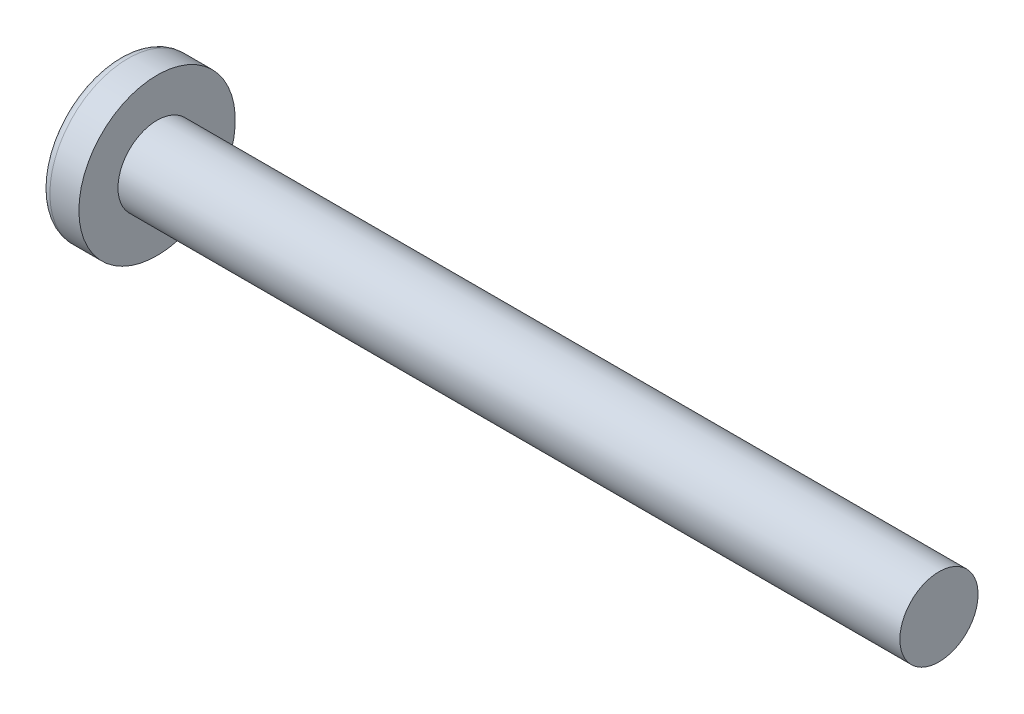
ISO-10303-21;
HEADER;
FILE_DESCRIPTION(('STEP AP214'),'2;1');
FILE_NAME('part.step','',(''),(''),'','','');
FILE_SCHEMA(('AUTOMOTIVE_DESIGN { 1 0 10303 214 1 1 1 1 }'));
ENDSEC;
DATA;
#1=APPLICATION_CONTEXT('core data for automotive mechanical design processes');
#2=APPLICATION_PROTOCOL_DEFINITION('international standard','automotive_design',2000,#1);
#3=PRODUCT_CONTEXT('',#1,'mechanical');
#4=PRODUCT('Part','Part','',(#3));
#5=PRODUCT_RELATED_PRODUCT_CATEGORY('part','',(#4));
#6=PRODUCT_DEFINITION_FORMATION('','',#4);
#7=PRODUCT_DEFINITION_CONTEXT('part definition',#1,'design');
#8=PRODUCT_DEFINITION('design','',#6,#7);
#9=PRODUCT_DEFINITION_SHAPE('','',#8);
#10=(LENGTH_UNIT() NAMED_UNIT(*) SI_UNIT(.MILLI.,.METRE.));
#11=(NAMED_UNIT(*) PLANE_ANGLE_UNIT() SI_UNIT($,.RADIAN.));
#12=(NAMED_UNIT(*) SI_UNIT($,.STERADIAN.) SOLID_ANGLE_UNIT());
#13=UNCERTAINTY_MEASURE_WITH_UNIT(LENGTH_MEASURE(1.E-05),#10,'distance_accuracy_value','');
#14=(GEOMETRIC_REPRESENTATION_CONTEXT(3) GLOBAL_UNCERTAINTY_ASSIGNED_CONTEXT((#13)) GLOBAL_UNIT_ASSIGNED_CONTEXT((#10,
#11,#12)) REPRESENTATION_CONTEXT('',''));
#15=CARTESIAN_POINT('',(0.,0.,0.));
#16=DIRECTION('',(0.,0.,1.));
#17=DIRECTION('',(1.,0.,0.));
#18=AXIS2_PLACEMENT_3D('',#15,#16,#17);
#19=CARTESIAN_POINT('',(6.5,0.,0.));
#20=DIRECTION('',(-1.,0.,0.));
#21=DIRECTION('',(0.,1.,0.));
#22=AXIS2_PLACEMENT_3D('',#19,#20,#21);
#23=SPHERICAL_SURFACE('',#22,6.5);
#24=CARTESIAN_POINT('',(1.22696010591455,0.,0.));
#25=DIRECTION('',(-1.,0.,0.));
#26=DIRECTION('',(0.,0.,1.));
#27=AXIS2_PLACEMENT_3D('',#24,#25,#26);
#28=CIRCLE('',#27,3.80066445182724);
#29=CARTESIAN_POINT('',(1.22696010591455,0.,3.80066445182724));
#30=VERTEX_POINT('',#29);
#31=EDGE_CURVE('E172',#30,#30,#28,.T.);
#32=ORIENTED_EDGE('',*,*,#31,.T.);
#33=EDGE_LOOP('',(#32));
#34=FACE_BOUND('',#33,.T.);
#35=CARTESIAN_POINT('',(6.48571960757402,-0.15048155459631,0.));
#36=DIRECTION('',(-0.0944735162161081,-0.995527375180494,0.));
#37=DIRECTION('',(0.995527375180494,-0.0944735162161081,0.));
#38=AXIS2_PLACEMENT_3D('',#35,#36,#37);
#39=CIRCLE('',#38,6.49824217555167);
#40=CARTESIAN_POINT('',(0.314004666074212,0.4352015980154,1.94783502836694));
#41=VERTEX_POINT('',#40);
#42=CARTESIAN_POINT('',(0.0329034112486444,0.461877533422321,0.461877533422323));
#43=VERTEX_POINT('',#42);
#44=EDGE_CURVE('E214',#41,#43,#39,.T.);
#45=ORIENTED_EDGE('',*,*,#44,.F.);
#46=CARTESIAN_POINT('',(5.02565375064329,0.,-1.83590765485334));
#47=DIRECTION('',(0.626149356629992,0.,0.779703137861998));
#48=DIRECTION('',(0.779703137861998,0.,-0.626149356629992));
#49=AXIS2_PLACEMENT_3D('',#46,#47,#48);
#50=CIRCLE('',#49,6.05852673674539);
#51=CARTESIAN_POINT('',(0.314004666074212,-0.435201598015413,1.94783502836693));
#52=VERTEX_POINT('',#51);
#53=EDGE_CURVE('E167',#41,#52,#50,.T.);
#54=ORIENTED_EDGE('',*,*,#53,.T.);
#55=CARTESIAN_POINT('',(6.48571960757402,0.15048155459631,0.));
#56=DIRECTION('',(-0.0944735162161081,0.995527375180494,0.));
#57=DIRECTION('',(-0.995527375180494,-0.0944735162161081,0.));
#58=AXIS2_PLACEMENT_3D('',#55,#56,#57);
#59=CIRCLE('',#58,6.49824217555167);
#60=CARTESIAN_POINT('',(0.0329034112486444,-0.461877533422324,0.461877533422322));
#61=VERTEX_POINT('',#60);
#62=EDGE_CURVE('E116',#61,#52,#59,.T.);
#63=ORIENTED_EDGE('',*,*,#62,.F.);
#64=CARTESIAN_POINT('',(6.48571960757402,0.,-0.15048155459631));
#65=DIRECTION('',(-0.0944735162161081,0.,-0.995527375180494));
#66=DIRECTION('',(-0.995527375180494,0.,0.0944735162161081));
#67=AXIS2_PLACEMENT_3D('',#64,#65,#66);
#68=CIRCLE('',#67,6.49824217555167);
#69=CARTESIAN_POINT('',(0.314004666074212,-1.94783502836693,0.435201598015406));
#70=VERTEX_POINT('',#69);
#71=EDGE_CURVE('E143',#70,#61,#68,.T.);
#72=ORIENTED_EDGE('',*,*,#71,.F.);
#73=CARTESIAN_POINT('',(5.02565375064329,1.83590765485334,0.));
#74=DIRECTION('',(0.626149356629992,-0.779703137861998,0.));
#75=DIRECTION('',(0.779703137861998,0.626149356629992,0.));
#76=AXIS2_PLACEMENT_3D('',#73,#74,#75);
#77=CIRCLE('',#76,6.05852673674539);
#78=CARTESIAN_POINT('',(0.314004666074212,-1.94783502836693,-0.435201598015406));
#79=VERTEX_POINT('',#78);
#80=EDGE_CURVE('E152',#70,#79,#77,.T.);
#81=ORIENTED_EDGE('',*,*,#80,.T.);
#82=CARTESIAN_POINT('',(6.48571960757402,0.,0.15048155459631));
#83=DIRECTION('',(-0.0944735162161081,0.,0.995527375180494));
#84=DIRECTION('',(0.995527375180494,0.,0.0944735162161081));
#85=AXIS2_PLACEMENT_3D('',#82,#83,#84);
#86=CIRCLE('',#85,6.49824217555167);
#87=CARTESIAN_POINT('',(0.0329034112486444,-0.461877533422321,-0.461877533422323));
#88=VERTEX_POINT('',#87);
#89=EDGE_CURVE('E59',#88,#79,#86,.T.);
#90=ORIENTED_EDGE('',*,*,#89,.F.);
#91=CARTESIAN_POINT('',(0.314004666074212,-0.435201598015399,-1.94783502836693));
#92=VERTEX_POINT('',#91);
#93=EDGE_CURVE('E221',#92,#88,#59,.T.);
#94=ORIENTED_EDGE('',*,*,#93,.F.);
#95=CARTESIAN_POINT('',(5.02565375064329,0.,1.83590765485334));
#96=DIRECTION('',(0.626149356629992,0.,-0.779703137861998));
#97=DIRECTION('',(-0.779703137861998,0.,-0.626149356629992));
#98=AXIS2_PLACEMENT_3D('',#95,#96,#97);
#99=CIRCLE('',#98,6.05852673674539);
#100=CARTESIAN_POINT('',(0.314004666074212,0.435201598015413,-1.94783502836693));
#101=VERTEX_POINT('',#100);
#102=EDGE_CURVE('E145',#92,#101,#99,.T.);
#103=ORIENTED_EDGE('',*,*,#102,.T.);
#104=CARTESIAN_POINT('',(0.0329034112486444,0.461877533422324,-0.461877533422323));
#105=VERTEX_POINT('',#104);
#106=EDGE_CURVE('E210',#105,#101,#39,.T.);
#107=ORIENTED_EDGE('',*,*,#106,.F.);
#108=CARTESIAN_POINT('',(0.314004666074212,1.94783502836693,-0.435201598015406));
#109=VERTEX_POINT('',#108);
#110=EDGE_CURVE('E52',#109,#105,#86,.T.);
#111=ORIENTED_EDGE('',*,*,#110,.F.);
#112=CARTESIAN_POINT('',(5.02565375064329,-1.83590765485334,0.));
#113=DIRECTION('',(0.626149356629992,0.779703137861998,0.));
#114=DIRECTION('',(-0.779703137861998,0.626149356629992,0.));
#115=AXIS2_PLACEMENT_3D('',#112,#113,#114);
#116=CIRCLE('',#115,6.05852673674539);
#117=CARTESIAN_POINT('',(0.314004666074212,1.94783502836693,0.435201598015407));
#118=VERTEX_POINT('',#117);
#119=EDGE_CURVE('E11',#109,#118,#116,.T.);
#120=ORIENTED_EDGE('',*,*,#119,.T.);
#121=EDGE_CURVE('E191',#43,#118,#68,.T.);
#122=ORIENTED_EDGE('',*,*,#121,.F.);
#123=EDGE_LOOP('',(#45,#54,#63,#72,#81,#90,#94,#103,#107,#111,#120,#122));
#124=FACE_BOUND('',#123,.T.);
#125=ADVANCED_FACE('F43',(#34,#124),#23,.T.);
#126=CARTESIAN_POINT('',(2.73951715374841,0.,-0.20502541296061));
#127=DIRECTION('',(-0.0944735162161081,0.,0.995527375180494));
#128=DIRECTION('',(0.995527375180494,0.,0.0944735162161081));
#129=AXIS2_PLACEMENT_3D('',#126,#127,#128);
#130=PLANE('',#129);
#131=ORIENTED_EDGE('',*,*,#110,.T.);
#132=DIRECTION('',(0.991114231601325,-0.0940547178968607,0.0940547178968604));
#133=VECTOR('',#132,1.);
#134=CARTESIAN_POINT('',(2.75862941145706,0.203211698708667,-0.203211698708667));
#135=LINE('',#134,#133);
#136=CARTESIAN_POINT('',(2.45,0.232500000000001,-0.232499999999999));
#137=VERTEX_POINT('',#136);
#138=EDGE_CURVE('E211',#105,#137,#135,.T.);
#139=ORIENTED_EDGE('',*,*,#138,.T.);
#140=DIRECTION('',(0.777577482844895,-0.624442325509115,0.0737905162291584));
#141=VECTOR('',#140,1.);
#142=CARTESIAN_POINT('',(0.,2.2,-0.465));
#143=LINE('',#142,#141);
#144=EDGE_CURVE('E173',#109,#137,#143,.T.);
#145=ORIENTED_EDGE('',*,*,#144,.F.);
#146=EDGE_LOOP('',(#131,#139,#145));
#147=FACE_BOUND('',#146,.T.);
#148=ADVANCED_FACE('F254',(#147),#130,.T.);
#149=DIRECTION('',(0.777577482844895,0.624442325509115,0.0737905162291584));
#150=VECTOR('',#149,1.);
#151=CARTESIAN_POINT('',(0.,-2.2,-0.465));
#152=LINE('',#151,#150);
#153=CARTESIAN_POINT('',(2.45,-0.2325,-0.2325));
#154=VERTEX_POINT('',#153);
#155=EDGE_CURVE('E154',#79,#154,#152,.T.);
#156=ORIENTED_EDGE('',*,*,#155,.T.);
#157=DIRECTION('',(-0.991114231601325,-0.09405471789686,-0.0940547178968604));
#158=VECTOR('',#157,1.);
#159=CARTESIAN_POINT('',(2.75862941145706,-0.203211698708666,-0.203211698708667));
#160=LINE('',#159,#158);
#161=EDGE_CURVE('E222',#154,#88,#160,.T.);
#162=ORIENTED_EDGE('',*,*,#161,.T.);
#163=ORIENTED_EDGE('',*,*,#89,.T.);
#164=EDGE_LOOP('',(#156,#162,#163));
#165=FACE_BOUND('',#164,.T.);
#166=ADVANCED_FACE('F251',(#165),#130,.T.);
#167=CARTESIAN_POINT('',(2.73951715374841,0.,0.20502541296061));
#168=DIRECTION('',(-0.0944735162161081,0.,-0.995527375180494));
#169=DIRECTION('',(-0.995527375180494,0.,0.0944735162161081));
#170=AXIS2_PLACEMENT_3D('',#167,#168,#169);
#171=PLANE('',#170);
#172=DIRECTION('',(0.777577482844895,-0.624442325509115,-0.0737905162291584));
#173=VECTOR('',#172,1.);
#174=CARTESIAN_POINT('',(0.,2.2,0.465));
#175=LINE('',#174,#173);
#176=CARTESIAN_POINT('',(2.45,0.2325,0.2325));
#177=VERTEX_POINT('',#176);
#178=EDGE_CURVE('E202',#118,#177,#175,.T.);
#179=ORIENTED_EDGE('',*,*,#178,.T.);
#180=DIRECTION('',(-0.991114231601325,0.0940547178968601,0.0940547178968603));
#181=VECTOR('',#180,1.);
#182=CARTESIAN_POINT('',(2.75862941145706,0.203211698708666,0.203211698708667));
#183=LINE('',#182,#181);
#184=EDGE_CURVE('E217',#177,#43,#183,.T.);
#185=ORIENTED_EDGE('',*,*,#184,.T.);
#186=ORIENTED_EDGE('',*,*,#121,.T.);
#187=EDGE_LOOP('',(#179,#185,#186));
#188=FACE_BOUND('',#187,.T.);
#189=ADVANCED_FACE('F253',(#188),#171,.T.);
#190=ORIENTED_EDGE('',*,*,#71,.T.);
#191=DIRECTION('',(0.991114231601325,0.0940547178968607,-0.0940547178968603));
#192=VECTOR('',#191,1.);
#193=CARTESIAN_POINT('',(2.75862941145706,-0.203211698708668,0.203211698708667));
#194=LINE('',#193,#192);
#195=CARTESIAN_POINT('',(2.45,-0.232500000000001,0.232499999999999));
#196=VERTEX_POINT('',#195);
#197=EDGE_CURVE('E114',#61,#196,#194,.T.);
#198=ORIENTED_EDGE('',*,*,#197,.T.);
#199=DIRECTION('',(0.777577482844895,0.624442325509115,-0.0737905162291583));
#200=VECTOR('',#199,1.);
#201=CARTESIAN_POINT('',(0.,-2.2,0.465));
#202=LINE('',#201,#200);
#203=EDGE_CURVE('E141',#70,#196,#202,.T.);
#204=ORIENTED_EDGE('',*,*,#203,.F.);
#205=EDGE_LOOP('',(#190,#198,#204));
#206=FACE_BOUND('',#205,.T.);
#207=ADVANCED_FACE('F140',(#206),#171,.T.);
#208=CARTESIAN_POINT('',(-25.4,0.,0.));
#209=DIRECTION('',(-1.,0.,0.));
#210=DIRECTION('',(0.,0.,1.));
#211=AXIS2_PLACEMENT_3D('',#208,#209,#210);
#212=CYLINDRICAL_SURFACE('',#211,2.);
#213=CARTESIAN_POINT('',(43.1,0.,0.));
#214=DIRECTION('',(-1.,0.,0.));
#215=DIRECTION('',(0.,0.,1.));
#216=AXIS2_PLACEMENT_3D('',#213,#214,#215);
#217=CIRCLE('',#216,2.);
#218=CARTESIAN_POINT('',(43.1,0.,2.));
#219=VERTEX_POINT('',#218);
#220=EDGE_CURVE('E168',#219,#219,#217,.T.);
#221=ORIENTED_EDGE('',*,*,#220,.T.);
#222=EDGE_LOOP('',(#221));
#223=FACE_BOUND('',#222,.T.);
#224=CARTESIAN_POINT('',(3.1,0.,0.));
#225=DIRECTION('',(-1.,0.,0.));
#226=DIRECTION('',(0.,0.,1.));
#227=AXIS2_PLACEMENT_3D('',#224,#225,#226);
#228=CIRCLE('',#227,2.);
#229=CARTESIAN_POINT('',(3.1,0.,2.));
#230=VERTEX_POINT('',#229);
#231=EDGE_CURVE('E185',#230,#230,#228,.T.);
#232=ORIENTED_EDGE('',*,*,#231,.F.);
#233=EDGE_LOOP('',(#232));
#234=FACE_BOUND('',#233,.T.);
#235=ADVANCED_FACE('F45',(#223,#234),#212,.T.);
#236=CARTESIAN_POINT('',(3.1,2.,0.));
#237=DIRECTION('',(-1.,0.,0.));
#238=DIRECTION('',(0.,0.,1.));
#239=AXIS2_PLACEMENT_3D('',#236,#237,#238);
#240=PLANE('',#239);
#241=CARTESIAN_POINT('',(3.1,0.,0.));
#242=DIRECTION('',(-1.,0.,0.));
#243=DIRECTION('',(0.,0.,1.));
#244=AXIS2_PLACEMENT_3D('',#241,#242,#243);
#245=CIRCLE('',#244,4.);
#246=CARTESIAN_POINT('',(3.1,0.,4.));
#247=VERTEX_POINT('',#246);
#248=EDGE_CURVE('E181',#247,#247,#245,.T.);
#249=ORIENTED_EDGE('',*,*,#248,.F.);
#250=EDGE_LOOP('',(#249));
#251=FACE_BOUND('',#250,.T.);
#252=ORIENTED_EDGE('',*,*,#231,.T.);
#253=EDGE_LOOP('',(#252));
#254=FACE_BOUND('',#253,.T.);
#255=ADVANCED_FACE('F278',(#251,#254),#240,.F.);
#256=CARTESIAN_POINT('',(-25.4,0.,0.));
#257=DIRECTION('',(-1.,0.,0.));
#258=DIRECTION('',(0.,0.,1.));
#259=AXIS2_PLACEMENT_3D('',#256,#257,#258);
#260=CYLINDRICAL_SURFACE('',#259,4.);
#261=ORIENTED_EDGE('',*,*,#248,.T.);
#262=EDGE_LOOP('',(#261));
#263=FACE_BOUND('',#262,.T.);
#264=CARTESIAN_POINT('',(1.61635382117009,0.,0.));
#265=DIRECTION('',(-1.,0.,0.));
#266=DIRECTION('',(0.,0.,1.));
#267=AXIS2_PLACEMENT_3D('',#264,#265,#266);
#268=CIRCLE('',#267,4.);
#269=CARTESIAN_POINT('',(1.61635382117009,0.,4.));
#270=VERTEX_POINT('',#269);
#271=EDGE_CURVE('E177',#270,#270,#268,.T.);
#272=ORIENTED_EDGE('',*,*,#271,.F.);
#273=EDGE_LOOP('',(#272));
#274=FACE_BOUND('',#273,.T.);
#275=ADVANCED_FACE('F275',(#263,#274),#260,.T.);
#276=CARTESIAN_POINT('',(1.61635382117009,0.,0.));
#277=DIRECTION('',(-1.,0.,0.));
#278=DIRECTION('',(0.,0.,1.));
#279=AXIS2_PLACEMENT_3D('',#276,#277,#278);
#280=TOROIDAL_SURFACE('',#279,3.52,0.48);
#281=ORIENTED_EDGE('',*,*,#271,.T.);
#282=EDGE_LOOP('',(#281));
#283=FACE_BOUND('',#282,.T.);
#284=ORIENTED_EDGE('',*,*,#31,.F.);
#285=EDGE_LOOP('',(#284));
#286=FACE_BOUND('',#285,.T.);
#287=ADVANCED_FACE('F272',(#283,#286),#280,.T.);
#288=CARTESIAN_POINT('',(43.1,2.,0.));
#289=DIRECTION('',(1.,0.,0.));
#290=DIRECTION('',(0.,0.,-1.));
#291=AXIS2_PLACEMENT_3D('',#288,#289,#290);
#292=PLANE('',#291);
#293=ORIENTED_EDGE('',*,*,#220,.F.);
#294=EDGE_LOOP('',(#293));
#295=FACE_BOUND('',#294,.T.);
#296=ADVANCED_FACE('F270',(#295),#292,.T.);
#297=CARTESIAN_POINT('',(2.45,0.2325,0.2325));
#298=DIRECTION('',(0.626149356629992,0.779703137861998,0.));
#299=DIRECTION('',(-0.779703137861998,0.626149356629992,0.));
#300=AXIS2_PLACEMENT_3D('',#297,#298,#299);
#301=PLANE('',#300);
#302=ORIENTED_EDGE('',*,*,#144,.T.);
#303=DIRECTION('',(0.,0.,-1.));
#304=VECTOR('',#303,1.);
#305=CARTESIAN_POINT('',(2.45,0.2325,0.2325));
#306=LINE('',#305,#304);
#307=EDGE_CURVE('E134',#177,#137,#306,.T.);
#308=ORIENTED_EDGE('',*,*,#307,.F.);
#309=ORIENTED_EDGE('',*,*,#178,.F.);
#310=ORIENTED_EDGE('',*,*,#119,.F.);
#311=EDGE_LOOP('',(#302,#308,#309,#310));
#312=FACE_BOUND('',#311,.T.);
#313=ADVANCED_FACE('F300',(#312),#301,.F.);
#314=CARTESIAN_POINT('',(2.45,-0.2325,-0.2325));
#315=DIRECTION('',(0.626149356629992,-0.779703137861998,0.));
#316=DIRECTION('',(0.779703137861998,0.626149356629992,0.));
#317=AXIS2_PLACEMENT_3D('',#314,#315,#316);
#318=PLANE('',#317);
#319=ORIENTED_EDGE('',*,*,#203,.T.);
#320=DIRECTION('',(0.,0.,1.));
#321=VECTOR('',#320,1.);
#322=CARTESIAN_POINT('',(2.45,-0.2325,-0.2325));
#323=LINE('',#322,#321);
#324=EDGE_CURVE('E133',#154,#196,#323,.T.);
#325=ORIENTED_EDGE('',*,*,#324,.F.);
#326=ORIENTED_EDGE('',*,*,#155,.F.);
#327=ORIENTED_EDGE('',*,*,#80,.F.);
#328=EDGE_LOOP('',(#319,#325,#326,#327));
#329=FACE_BOUND('',#328,.T.);
#330=ADVANCED_FACE('F149',(#329),#318,.F.);
#331=CARTESIAN_POINT('',(2.45,0.2325,-0.2325));
#332=DIRECTION('',(-1.,0.,0.));
#333=DIRECTION('',(0.,0.,1.));
#334=AXIS2_PLACEMENT_3D('',#331,#332,#333);
#335=PLANE('',#334);
#336=DIRECTION('',(0.,1.,0.));
#337=VECTOR('',#336,1.);
#338=CARTESIAN_POINT('',(2.45,-0.2325,-0.2325));
#339=LINE('',#338,#337);
#340=EDGE_CURVE('E158',#154,#137,#339,.T.);
#341=ORIENTED_EDGE('',*,*,#340,.F.);
#342=ORIENTED_EDGE('',*,*,#324,.T.);
#343=DIRECTION('',(0.,-1.,0.));
#344=VECTOR('',#343,1.);
#345=CARTESIAN_POINT('',(2.45,0.2325,0.2325));
#346=LINE('',#345,#344);
#347=EDGE_CURVE('E124',#177,#196,#346,.T.);
#348=ORIENTED_EDGE('',*,*,#347,.F.);
#349=ORIENTED_EDGE('',*,*,#307,.T.);
#350=EDGE_LOOP('',(#341,#342,#348,#349));
#351=FACE_BOUND('',#350,.T.);
#352=ADVANCED_FACE('F156',(#351),#335,.T.);
#353=CARTESIAN_POINT('',(2.45,0.232500000000001,-0.232499999999999));
#354=DIRECTION('',(0.626149356629992,0.,-0.779703137861998));
#355=DIRECTION('',(0.779703137861998,0.,0.626149356629992));
#356=AXIS2_PLACEMENT_3D('',#353,#354,#355);
#357=PLANE('',#356);
#358=DIRECTION('',(0.777577482844895,0.0737905162291561,0.624442325509115));
#359=VECTOR('',#358,1.);
#360=CARTESIAN_POINT('',(0.,-0.464999999999992,-2.2));
#361=LINE('',#360,#359);
#362=EDGE_CURVE('E230',#92,#154,#361,.T.);
#363=ORIENTED_EDGE('',*,*,#362,.T.);
#364=ORIENTED_EDGE('',*,*,#340,.T.);
#365=DIRECTION('',(0.777577482844895,-0.0737905162291606,0.624442325509114));
#366=VECTOR('',#365,1.);
#367=CARTESIAN_POINT('',(0.,0.465000000000008,-2.2));
#368=LINE('',#367,#366);
#369=EDGE_CURVE('E121',#101,#137,#368,.T.);
#370=ORIENTED_EDGE('',*,*,#369,.F.);
#371=ORIENTED_EDGE('',*,*,#102,.F.);
#372=EDGE_LOOP('',(#363,#364,#370,#371));
#373=FACE_BOUND('',#372,.T.);
#374=ADVANCED_FACE('F244',(#373),#357,.F.);
#375=CARTESIAN_POINT('',(2.73951715374841,-0.20502541296061,0.));
#376=DIRECTION('',(-0.0944735162161081,0.995527375180494,0.));
#377=DIRECTION('',(-0.995527375180494,-0.0944735162161081,0.));
#378=AXIS2_PLACEMENT_3D('',#375,#376,#377);
#379=PLANE('',#378);
#380=ORIENTED_EDGE('',*,*,#93,.T.);
#381=ORIENTED_EDGE('',*,*,#161,.F.);
#382=ORIENTED_EDGE('',*,*,#362,.F.);
#383=EDGE_LOOP('',(#380,#381,#382));
#384=FACE_BOUND('',#383,.T.);
#385=ADVANCED_FACE('F250',(#384),#379,.T.);
#386=CARTESIAN_POINT('',(2.73951715374841,0.20502541296061,0.));
#387=DIRECTION('',(-0.0944735162161081,-0.995527375180494,0.));
#388=DIRECTION('',(0.995527375180494,-0.0944735162161081,0.));
#389=AXIS2_PLACEMENT_3D('',#386,#387,#388);
#390=PLANE('',#389);
#391=ORIENTED_EDGE('',*,*,#106,.T.);
#392=ORIENTED_EDGE('',*,*,#369,.T.);
#393=ORIENTED_EDGE('',*,*,#138,.F.);
#394=EDGE_LOOP('',(#391,#392,#393));
#395=FACE_BOUND('',#394,.T.);
#396=ADVANCED_FACE('F241',(#395),#390,.T.);
#397=CARTESIAN_POINT('',(2.45,-0.232500000000001,0.232499999999999));
#398=DIRECTION('',(0.626149356629992,0.,0.779703137861998));
#399=DIRECTION('',(-0.779703137861998,0.,0.626149356629992));
#400=AXIS2_PLACEMENT_3D('',#397,#398,#399);
#401=PLANE('',#400);
#402=DIRECTION('',(0.777577482844895,-0.0737905162291562,-0.624442325509115));
#403=VECTOR('',#402,1.);
#404=CARTESIAN_POINT('',(0.,0.464999999999992,2.2));
#405=LINE('',#404,#403);
#406=EDGE_CURVE('E120',#41,#177,#405,.T.);
#407=ORIENTED_EDGE('',*,*,#406,.T.);
#408=ORIENTED_EDGE('',*,*,#347,.T.);
#409=DIRECTION('',(0.777577482844895,0.0737905162291606,-0.624442325509114));
#410=VECTOR('',#409,1.);
#411=CARTESIAN_POINT('',(0.,-0.465000000000008,2.2));
#412=LINE('',#411,#410);
#413=EDGE_CURVE('E110',#52,#196,#412,.T.);
#414=ORIENTED_EDGE('',*,*,#413,.F.);
#415=ORIENTED_EDGE('',*,*,#53,.F.);
#416=EDGE_LOOP('',(#407,#408,#414,#415));
#417=FACE_BOUND('',#416,.T.);
#418=ADVANCED_FACE('F125',(#417),#401,.F.);
#419=ORIENTED_EDGE('',*,*,#44,.T.);
#420=ORIENTED_EDGE('',*,*,#184,.F.);
#421=ORIENTED_EDGE('',*,*,#406,.F.);
#422=EDGE_LOOP('',(#419,#420,#421));
#423=FACE_BOUND('',#422,.T.);
#424=ADVANCED_FACE('F315',(#423),#390,.T.);
#425=ORIENTED_EDGE('',*,*,#62,.T.);
#426=ORIENTED_EDGE('',*,*,#413,.T.);
#427=ORIENTED_EDGE('',*,*,#197,.F.);
#428=EDGE_LOOP('',(#425,#426,#427));
#429=FACE_BOUND('',#428,.T.);
#430=ADVANCED_FACE('F112',(#429),#379,.T.);
#431=CLOSED_SHELL('',(#125,#148,#166,#189,#207,#235,#255,#275,#287,#296,#313,#330,#352,#374,
#385,#396,#418,#424,#430));
#432=MANIFOLD_SOLID_BREP('B2',#431);
#433=ADVANCED_BREP_SHAPE_REPRESENTATION('',(#18,#432),#14);
#434=SHAPE_DEFINITION_REPRESENTATION(#9,#433);
ENDSEC;
END-ISO-10303-21;
